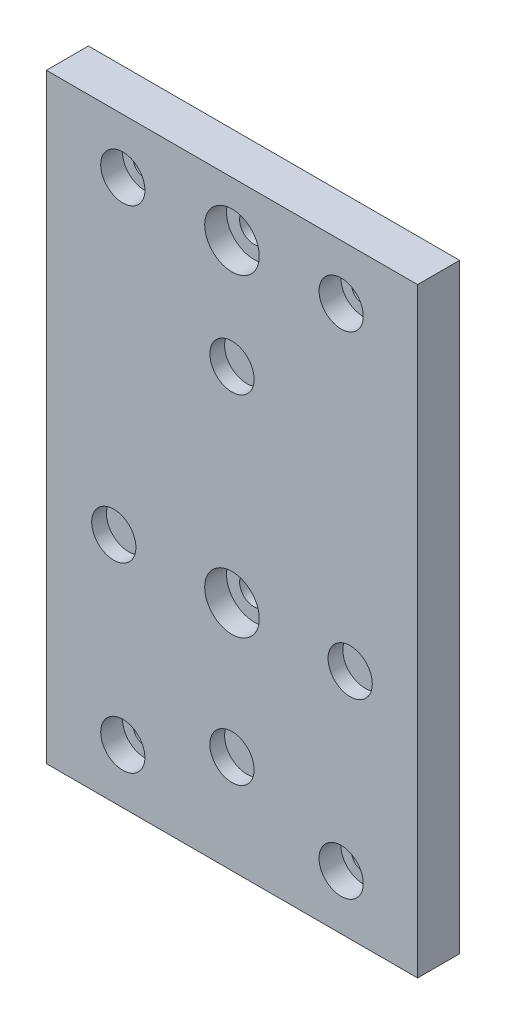
ISO-10303-21;
HEADER;
FILE_DESCRIPTION(('STEP AP214'),'2;1');
FILE_NAME('part.step','',(''),(''),'','','');
FILE_SCHEMA(('AUTOMOTIVE_DESIGN { 1 0 10303 214 1 1 1 1 }'));
ENDSEC;
DATA;
#1=APPLICATION_CONTEXT('core data for automotive mechanical design processes');
#2=APPLICATION_PROTOCOL_DEFINITION('international standard','automotive_design',2000,#1);
#3=PRODUCT_CONTEXT('',#1,'mechanical');
#4=PRODUCT('Part','Part','',(#3));
#5=PRODUCT_RELATED_PRODUCT_CATEGORY('part','',(#4));
#6=PRODUCT_DEFINITION_FORMATION('','',#4);
#7=PRODUCT_DEFINITION_CONTEXT('part definition',#1,'design');
#8=PRODUCT_DEFINITION('design','',#6,#7);
#9=PRODUCT_DEFINITION_SHAPE('','',#8);
#10=(LENGTH_UNIT() NAMED_UNIT(*) SI_UNIT(.MILLI.,.METRE.));
#11=(NAMED_UNIT(*) PLANE_ANGLE_UNIT() SI_UNIT($,.RADIAN.));
#12=(NAMED_UNIT(*) SI_UNIT($,.STERADIAN.) SOLID_ANGLE_UNIT());
#13=UNCERTAINTY_MEASURE_WITH_UNIT(LENGTH_MEASURE(1.E-05),#10,'distance_accuracy_value','');
#14=(GEOMETRIC_REPRESENTATION_CONTEXT(3) GLOBAL_UNCERTAINTY_ASSIGNED_CONTEXT((#13)) GLOBAL_UNIT_ASSIGNED_CONTEXT((#10,
#11,#12)) REPRESENTATION_CONTEXT('',''));
#15=CARTESIAN_POINT('',(0.,0.,0.));
#16=DIRECTION('',(0.,0.,1.));
#17=DIRECTION('',(1.,0.,0.));
#18=AXIS2_PLACEMENT_3D('',#15,#16,#17);
#19=CARTESIAN_POINT('',(0.,-36.95,7.7));
#20=DIRECTION('',(0.,0.,-1.));
#21=DIRECTION('',(-1.,0.,0.));
#22=AXIS2_PLACEMENT_3D('',#19,#20,#21);
#23=CYLINDRICAL_SURFACE('',#22,4.05);
#24=CARTESIAN_POINT('',(0.,-36.95,7.7));
#25=DIRECTION('',(0.,0.,1.));
#26=DIRECTION('',(1.,0.,0.));
#27=AXIS2_PLACEMENT_3D('',#24,#25,#26);
#28=CIRCLE('',#27,4.05);
#29=CARTESIAN_POINT('',(4.05,-36.95,7.7));
#30=VERTEX_POINT('',#29);
#31=EDGE_CURVE('E174',#30,#30,#28,.T.);
#32=ORIENTED_EDGE('',*,*,#31,.T.);
#33=EDGE_LOOP('',(#32));
#34=FACE_BOUND('',#33,.T.);
#35=CARTESIAN_POINT('',(0.,-36.95,5.));
#36=DIRECTION('',(0.,0.,-1.));
#37=DIRECTION('',(-1.,0.,0.));
#38=AXIS2_PLACEMENT_3D('',#35,#36,#37);
#39=CIRCLE('',#38,4.05);
#40=CARTESIAN_POINT('',(-4.05,-36.95,5.));
#41=VERTEX_POINT('',#40);
#42=EDGE_CURVE('E120',#41,#41,#39,.T.);
#43=ORIENTED_EDGE('',*,*,#42,.T.);
#44=EDGE_LOOP('',(#43));
#45=FACE_BOUND('',#44,.T.);
#46=ADVANCED_FACE('F33',(#34,#45),#23,.F.);
#47=CARTESIAN_POINT('',(-21.650635094611,-12.5,7.7));
#48=DIRECTION('',(0.,0.,-1.));
#49=DIRECTION('',(-1.,0.,0.));
#50=AXIS2_PLACEMENT_3D('',#47,#48,#49);
#51=CYLINDRICAL_SURFACE('',#50,4.05);
#52=CARTESIAN_POINT('',(-21.650635094611,-12.5,7.7));
#53=DIRECTION('',(0.,0.,1.));
#54=DIRECTION('',(1.,0.,0.));
#55=AXIS2_PLACEMENT_3D('',#52,#53,#54);
#56=CIRCLE('',#55,4.05);
#57=CARTESIAN_POINT('',(-17.600635094611,-12.5,7.7));
#58=VERTEX_POINT('',#57);
#59=EDGE_CURVE('E171',#58,#58,#56,.T.);
#60=ORIENTED_EDGE('',*,*,#59,.T.);
#61=EDGE_LOOP('',(#60));
#62=FACE_BOUND('',#61,.T.);
#63=CARTESIAN_POINT('',(-21.650635094611,-12.5,5.));
#64=DIRECTION('',(0.,0.,-1.));
#65=DIRECTION('',(-1.,0.,0.));
#66=AXIS2_PLACEMENT_3D('',#63,#64,#65);
#67=CIRCLE('',#66,4.05);
#68=CARTESIAN_POINT('',(-25.700635094611,-12.5,5.));
#69=VERTEX_POINT('',#68);
#70=EDGE_CURVE('E117',#69,#69,#67,.T.);
#71=ORIENTED_EDGE('',*,*,#70,.T.);
#72=EDGE_LOOP('',(#71));
#73=FACE_BOUND('',#72,.T.);
#74=ADVANCED_FACE('F236',(#62,#73),#51,.F.);
#75=CARTESIAN_POINT('',(0.,25.,7.7));
#76=DIRECTION('',(0.,0.,-1.));
#77=DIRECTION('',(-1.,0.,0.));
#78=AXIS2_PLACEMENT_3D('',#75,#76,#77);
#79=CYLINDRICAL_SURFACE('',#78,4.05);
#80=CARTESIAN_POINT('',(0.,25.,7.7));
#81=DIRECTION('',(0.,0.,1.));
#82=DIRECTION('',(1.,0.,0.));
#83=AXIS2_PLACEMENT_3D('',#80,#81,#82);
#84=CIRCLE('',#83,4.05);
#85=CARTESIAN_POINT('',(4.04999999999999,25.,7.7));
#86=VERTEX_POINT('',#85);
#87=EDGE_CURVE('E168',#86,#86,#84,.T.);
#88=ORIENTED_EDGE('',*,*,#87,.T.);
#89=EDGE_LOOP('',(#88));
#90=FACE_BOUND('',#89,.T.);
#91=CARTESIAN_POINT('',(0.,25.,5.));
#92=DIRECTION('',(0.,0.,-1.));
#93=DIRECTION('',(-1.,0.,0.));
#94=AXIS2_PLACEMENT_3D('',#91,#92,#93);
#95=CIRCLE('',#94,4.05);
#96=CARTESIAN_POINT('',(-4.05000000000001,25.,5.));
#97=VERTEX_POINT('',#96);
#98=EDGE_CURVE('E114',#97,#97,#95,.T.);
#99=ORIENTED_EDGE('',*,*,#98,.T.);
#100=EDGE_LOOP('',(#99));
#101=FACE_BOUND('',#100,.T.);
#102=ADVANCED_FACE('F242',(#90,#101),#79,.F.);
#103=CARTESIAN_POINT('',(21.650635094611,-12.5,7.7));
#104=DIRECTION('',(0.,0.,-1.));
#105=DIRECTION('',(-1.,0.,0.));
#106=AXIS2_PLACEMENT_3D('',#103,#104,#105);
#107=CYLINDRICAL_SURFACE('',#106,4.05);
#108=CARTESIAN_POINT('',(21.650635094611,-12.5,7.7));
#109=DIRECTION('',(0.,0.,1.));
#110=DIRECTION('',(1.,0.,0.));
#111=AXIS2_PLACEMENT_3D('',#108,#109,#110);
#112=CIRCLE('',#111,4.05);
#113=CARTESIAN_POINT('',(25.700635094611,-12.5,7.7));
#114=VERTEX_POINT('',#113);
#115=EDGE_CURVE('E165',#114,#114,#112,.T.);
#116=ORIENTED_EDGE('',*,*,#115,.T.);
#117=EDGE_LOOP('',(#116));
#118=FACE_BOUND('',#117,.T.);
#119=CARTESIAN_POINT('',(21.650635094611,-12.5,5.));
#120=DIRECTION('',(0.,0.,-1.));
#121=DIRECTION('',(-1.,0.,0.));
#122=AXIS2_PLACEMENT_3D('',#119,#120,#121);
#123=CIRCLE('',#122,4.05);
#124=CARTESIAN_POINT('',(17.600635094611,-12.5,5.));
#125=VERTEX_POINT('',#124);
#126=EDGE_CURVE('E110',#125,#125,#123,.T.);
#127=ORIENTED_EDGE('',*,*,#126,.T.);
#128=EDGE_LOOP('',(#127));
#129=FACE_BOUND('',#128,.T.);
#130=ADVANCED_FACE('F252',(#118,#129),#107,.F.);
#131=CARTESIAN_POINT('',(0.,0.,7.7));
#132=DIRECTION('',(0.,0.,1.));
#133=DIRECTION('',(1.,0.,0.));
#134=AXIS2_PLACEMENT_3D('',#131,#132,#133);
#135=PLANE('',#134);
#136=CARTESIAN_POINT('',(0.,45.,7.7));
#137=DIRECTION('',(0.,0.,-1.));
#138=DIRECTION('',(-1.,0.,0.));
#139=AXIS2_PLACEMENT_3D('',#136,#137,#138);
#140=CIRCLE('',#139,5.);
#141=CARTESIAN_POINT('',(-5.00000000000001,45.,7.7));
#142=VERTEX_POINT('',#141);
#143=EDGE_CURVE('E200',#142,#142,#140,.T.);
#144=ORIENTED_EDGE('',*,*,#143,.T.);
#145=EDGE_LOOP('',(#144));
#146=FACE_BOUND('',#145,.T.);
#147=CARTESIAN_POINT('',(-20.,-45.,7.7));
#148=DIRECTION('',(0.,0.,-1.));
#149=DIRECTION('',(-1.,0.,0.));
#150=AXIS2_PLACEMENT_3D('',#147,#148,#149);
#151=CIRCLE('',#150,4.05);
#152=CARTESIAN_POINT('',(-24.05,-45.,7.7));
#153=VERTEX_POINT('',#152);
#154=EDGE_CURVE('E207',#153,#153,#151,.T.);
#155=ORIENTED_EDGE('',*,*,#154,.T.);
#156=EDGE_LOOP('',(#155));
#157=FACE_BOUND('',#156,.T.);
#158=CARTESIAN_POINT('',(20.,-45.,7.7));
#159=DIRECTION('',(0.,0.,-1.));
#160=DIRECTION('',(-1.,0.,0.));
#161=AXIS2_PLACEMENT_3D('',#158,#159,#160);
#162=CIRCLE('',#161,4.05);
#163=CARTESIAN_POINT('',(15.95,-45.,7.7));
#164=VERTEX_POINT('',#163);
#165=EDGE_CURVE('E188',#164,#164,#162,.T.);
#166=ORIENTED_EDGE('',*,*,#165,.T.);
#167=EDGE_LOOP('',(#166));
#168=FACE_BOUND('',#167,.T.);
#169=CARTESIAN_POINT('',(-20.,45.,7.7));
#170=DIRECTION('',(0.,0.,-1.));
#171=DIRECTION('',(-1.,0.,0.));
#172=AXIS2_PLACEMENT_3D('',#169,#170,#171);
#173=CIRCLE('',#172,4.05);
#174=CARTESIAN_POINT('',(-24.05,45.,7.7));
#175=VERTEX_POINT('',#174);
#176=EDGE_CURVE('E195',#175,#175,#173,.T.);
#177=ORIENTED_EDGE('',*,*,#176,.T.);
#178=EDGE_LOOP('',(#177));
#179=FACE_BOUND('',#178,.T.);
#180=CARTESIAN_POINT('',(0.,-12.5,7.7));
#181=DIRECTION('',(0.,0.,-1.));
#182=DIRECTION('',(-1.,0.,0.));
#183=AXIS2_PLACEMENT_3D('',#180,#181,#182);
#184=CIRCLE('',#183,5.);
#185=CARTESIAN_POINT('',(-5.00000000000001,-12.5,7.7));
#186=VERTEX_POINT('',#185);
#187=EDGE_CURVE('E212',#186,#186,#184,.T.);
#188=ORIENTED_EDGE('',*,*,#187,.T.);
#189=EDGE_LOOP('',(#188));
#190=FACE_BOUND('',#189,.T.);
#191=CARTESIAN_POINT('',(20.,45.,7.7));
#192=DIRECTION('',(0.,0.,-1.));
#193=DIRECTION('',(-1.,0.,0.));
#194=AXIS2_PLACEMENT_3D('',#191,#192,#193);
#195=CIRCLE('',#194,4.05);
#196=CARTESIAN_POINT('',(15.95,45.,7.7));
#197=VERTEX_POINT('',#196);
#198=EDGE_CURVE('E182',#197,#197,#195,.T.);
#199=ORIENTED_EDGE('',*,*,#198,.T.);
#200=EDGE_LOOP('',(#199));
#201=FACE_BOUND('',#200,.T.);
#202=ORIENTED_EDGE('',*,*,#59,.F.);
#203=EDGE_LOOP('',(#202));
#204=FACE_BOUND('',#203,.T.);
#205=ORIENTED_EDGE('',*,*,#115,.F.);
#206=EDGE_LOOP('',(#205));
#207=FACE_BOUND('',#206,.T.);
#208=DIRECTION('',(0.,1.,0.));
#209=VECTOR('',#208,1.);
#210=CARTESIAN_POINT('',(34.,55.,7.7));
#211=LINE('',#210,#209);
#212=CARTESIAN_POINT('',(34.,-55.,7.7));
#213=VERTEX_POINT('',#212);
#214=CARTESIAN_POINT('',(34.,55.,7.7));
#215=VERTEX_POINT('',#214);
#216=EDGE_CURVE('E88',#213,#215,#211,.T.);
#217=ORIENTED_EDGE('',*,*,#216,.T.);
#218=DIRECTION('',(-1.,0.,0.));
#219=VECTOR('',#218,1.);
#220=CARTESIAN_POINT('',(-34.,55.,7.7));
#221=LINE('',#220,#219);
#222=CARTESIAN_POINT('',(-34.,55.,7.7));
#223=VERTEX_POINT('',#222);
#224=EDGE_CURVE('E82',#215,#223,#221,.T.);
#225=ORIENTED_EDGE('',*,*,#224,.T.);
#226=DIRECTION('',(0.,-1.,0.));
#227=VECTOR('',#226,1.);
#228=CARTESIAN_POINT('',(-34.,55.,7.7));
#229=LINE('',#228,#227);
#230=CARTESIAN_POINT('',(-34.,-55.,7.7));
#231=VERTEX_POINT('',#230);
#232=EDGE_CURVE('E86',#223,#231,#229,.T.);
#233=ORIENTED_EDGE('',*,*,#232,.T.);
#234=DIRECTION('',(1.,0.,0.));
#235=VECTOR('',#234,1.);
#236=CARTESIAN_POINT('',(-34.,-55.,7.7));
#237=LINE('',#236,#235);
#238=EDGE_CURVE('E52',#231,#213,#237,.T.);
#239=ORIENTED_EDGE('',*,*,#238,.T.);
#240=EDGE_LOOP('',(#217,#225,#233,#239));
#241=FACE_BOUND('',#240,.T.);
#242=ORIENTED_EDGE('',*,*,#87,.F.);
#243=EDGE_LOOP('',(#242));
#244=FACE_BOUND('',#243,.T.);
#245=ORIENTED_EDGE('',*,*,#31,.F.);
#246=EDGE_LOOP('',(#245));
#247=FACE_BOUND('',#246,.T.);
#248=ADVANCED_FACE('F83',(#146,#157,#168,#179,#190,#201,#204,#207,#241,#244,#247),#135,.T.);
#249=CARTESIAN_POINT('',(0.,0.,0.));
#250=DIRECTION('',(0.,0.,1.));
#251=DIRECTION('',(1.,0.,0.));
#252=AXIS2_PLACEMENT_3D('',#249,#250,#251);
#253=PLANE('',#252);
#254=DIRECTION('',(0.,1.,0.));
#255=VECTOR('',#254,1.);
#256=CARTESIAN_POINT('',(34.,55.,0.));
#257=LINE('',#256,#255);
#258=CARTESIAN_POINT('',(34.,-55.,0.));
#259=VERTEX_POINT('',#258);
#260=CARTESIAN_POINT('',(34.,55.,0.));
#261=VERTEX_POINT('',#260);
#262=EDGE_CURVE('E101',#259,#261,#257,.T.);
#263=ORIENTED_EDGE('',*,*,#262,.F.);
#264=DIRECTION('',(1.,0.,0.));
#265=VECTOR('',#264,1.);
#266=CARTESIAN_POINT('',(-34.,-55.,0.));
#267=LINE('',#266,#265);
#268=CARTESIAN_POINT('',(-34.,-55.,0.));
#269=VERTEX_POINT('',#268);
#270=EDGE_CURVE('E75',#269,#259,#267,.T.);
#271=ORIENTED_EDGE('',*,*,#270,.F.);
#272=DIRECTION('',(0.,-1.,0.));
#273=VECTOR('',#272,1.);
#274=CARTESIAN_POINT('',(-34.,55.,0.));
#275=LINE('',#274,#273);
#276=CARTESIAN_POINT('',(-34.,55.,0.));
#277=VERTEX_POINT('',#276);
#278=EDGE_CURVE('E69',#277,#269,#275,.T.);
#279=ORIENTED_EDGE('',*,*,#278,.F.);
#280=DIRECTION('',(-1.,0.,0.));
#281=VECTOR('',#280,1.);
#282=CARTESIAN_POINT('',(-34.,55.,0.));
#283=LINE('',#282,#281);
#284=EDGE_CURVE('E92',#261,#277,#283,.T.);
#285=ORIENTED_EDGE('',*,*,#284,.F.);
#286=EDGE_LOOP('',(#263,#271,#279,#285));
#287=FACE_BOUND('',#286,.T.);
#288=CARTESIAN_POINT('',(20.,45.,0.));
#289=DIRECTION('',(0.,0.,1.));
#290=DIRECTION('',(1.,0.,0.));
#291=AXIS2_PLACEMENT_3D('',#288,#289,#290);
#292=CIRCLE('',#291,2.1);
#293=CARTESIAN_POINT('',(22.1,45.,0.));
#294=VERTEX_POINT('',#293);
#295=EDGE_CURVE('E104',#294,#294,#292,.T.);
#296=ORIENTED_EDGE('',*,*,#295,.T.);
#297=EDGE_LOOP('',(#296));
#298=FACE_BOUND('',#297,.T.);
#299=CARTESIAN_POINT('',(-20.,45.,0.));
#300=DIRECTION('',(0.,0.,1.));
#301=DIRECTION('',(1.,0.,0.));
#302=AXIS2_PLACEMENT_3D('',#299,#300,#301);
#303=CIRCLE('',#302,2.1);
#304=CARTESIAN_POINT('',(-17.9,45.,0.));
#305=VERTEX_POINT('',#304);
#306=EDGE_CURVE('E154',#305,#305,#303,.T.);
#307=ORIENTED_EDGE('',*,*,#306,.T.);
#308=EDGE_LOOP('',(#307));
#309=FACE_BOUND('',#308,.T.);
#310=CARTESIAN_POINT('',(20.,-45.,0.));
#311=DIRECTION('',(0.,0.,1.));
#312=DIRECTION('',(1.,0.,0.));
#313=AXIS2_PLACEMENT_3D('',#310,#311,#312);
#314=CIRCLE('',#313,2.1);
#315=CARTESIAN_POINT('',(22.1,-45.,0.));
#316=VERTEX_POINT('',#315);
#317=EDGE_CURVE('E157',#316,#316,#314,.T.);
#318=ORIENTED_EDGE('',*,*,#317,.T.);
#319=EDGE_LOOP('',(#318));
#320=FACE_BOUND('',#319,.T.);
#321=CARTESIAN_POINT('',(-20.,-45.,0.));
#322=DIRECTION('',(0.,0.,1.));
#323=DIRECTION('',(1.,0.,0.));
#324=AXIS2_PLACEMENT_3D('',#321,#322,#323);
#325=CIRCLE('',#324,2.1);
#326=CARTESIAN_POINT('',(-17.9,-45.,0.));
#327=VERTEX_POINT('',#326);
#328=EDGE_CURVE('E162',#327,#327,#325,.T.);
#329=ORIENTED_EDGE('',*,*,#328,.T.);
#330=EDGE_LOOP('',(#329));
#331=FACE_BOUND('',#330,.T.);
#332=CARTESIAN_POINT('',(0.,45.,0.));
#333=DIRECTION('',(0.,0.,1.));
#334=DIRECTION('',(1.,0.,0.));
#335=AXIS2_PLACEMENT_3D('',#332,#333,#334);
#336=CIRCLE('',#335,2.6);
#337=CARTESIAN_POINT('',(2.59999999999999,45.,0.));
#338=VERTEX_POINT('',#337);
#339=EDGE_CURVE('E177',#338,#338,#336,.T.);
#340=ORIENTED_EDGE('',*,*,#339,.T.);
#341=EDGE_LOOP('',(#340));
#342=FACE_BOUND('',#341,.T.);
#343=CARTESIAN_POINT('',(0.,-12.5,0.));
#344=DIRECTION('',(0.,0.,1.));
#345=DIRECTION('',(1.,0.,0.));
#346=AXIS2_PLACEMENT_3D('',#343,#344,#345);
#347=CIRCLE('',#346,2.6);
#348=CARTESIAN_POINT('',(2.59999999999999,-12.5,0.));
#349=VERTEX_POINT('',#348);
#350=EDGE_CURVE('E113',#349,#349,#347,.T.);
#351=ORIENTED_EDGE('',*,*,#350,.T.);
#352=EDGE_LOOP('',(#351));
#353=FACE_BOUND('',#352,.T.);
#354=ADVANCED_FACE('F270',(#287,#298,#309,#320,#331,#342,#353),#253,.F.);
#355=CARTESIAN_POINT('',(34.,55.,7.7));
#356=DIRECTION('',(-1.,0.,0.));
#357=DIRECTION('',(0.,-1.,0.));
#358=AXIS2_PLACEMENT_3D('',#355,#356,#357);
#359=PLANE('',#358);
#360=ORIENTED_EDGE('',*,*,#262,.T.);
#361=DIRECTION('',(0.,0.,-1.));
#362=VECTOR('',#361,1.);
#363=CARTESIAN_POINT('',(34.,55.,7.7));
#364=LINE('',#363,#362);
#365=EDGE_CURVE('E11',#215,#261,#364,.T.);
#366=ORIENTED_EDGE('',*,*,#365,.F.);
#367=ORIENTED_EDGE('',*,*,#216,.F.);
#368=DIRECTION('',(0.,0.,-1.));
#369=VECTOR('',#368,1.);
#370=CARTESIAN_POINT('',(34.,-55.,7.7));
#371=LINE('',#370,#369);
#372=EDGE_CURVE('E97',#213,#259,#371,.T.);
#373=ORIENTED_EDGE('',*,*,#372,.T.);
#374=EDGE_LOOP('',(#360,#366,#367,#373));
#375=FACE_BOUND('',#374,.T.);
#376=ADVANCED_FACE('F35',(#375),#359,.F.);
#377=CARTESIAN_POINT('',(-34.,55.,7.7));
#378=DIRECTION('',(0.,-1.,0.));
#379=DIRECTION('',(0.,0.,-1.));
#380=AXIS2_PLACEMENT_3D('',#377,#378,#379);
#381=PLANE('',#380);
#382=ORIENTED_EDGE('',*,*,#284,.T.);
#383=DIRECTION('',(0.,0.,-1.));
#384=VECTOR('',#383,1.);
#385=CARTESIAN_POINT('',(-34.,55.,7.7));
#386=LINE('',#385,#384);
#387=EDGE_CURVE('E43',#223,#277,#386,.T.);
#388=ORIENTED_EDGE('',*,*,#387,.F.);
#389=ORIENTED_EDGE('',*,*,#224,.F.);
#390=ORIENTED_EDGE('',*,*,#365,.T.);
#391=EDGE_LOOP('',(#382,#388,#389,#390));
#392=FACE_BOUND('',#391,.T.);
#393=ADVANCED_FACE('F91',(#392),#381,.F.);
#394=CARTESIAN_POINT('',(-34.,55.,7.7));
#395=DIRECTION('',(1.,0.,0.));
#396=DIRECTION('',(0.,1.,0.));
#397=AXIS2_PLACEMENT_3D('',#394,#395,#396);
#398=PLANE('',#397);
#399=ORIENTED_EDGE('',*,*,#278,.T.);
#400=DIRECTION('',(0.,0.,-1.));
#401=VECTOR('',#400,1.);
#402=CARTESIAN_POINT('',(-34.,-55.,7.7));
#403=LINE('',#402,#401);
#404=EDGE_CURVE('E93',#231,#269,#403,.T.);
#405=ORIENTED_EDGE('',*,*,#404,.F.);
#406=ORIENTED_EDGE('',*,*,#232,.F.);
#407=ORIENTED_EDGE('',*,*,#387,.T.);
#408=EDGE_LOOP('',(#399,#405,#406,#407));
#409=FACE_BOUND('',#408,.T.);
#410=ADVANCED_FACE('F95',(#409),#398,.F.);
#411=CARTESIAN_POINT('',(-34.,-55.,7.7));
#412=DIRECTION('',(0.,1.,0.));
#413=DIRECTION('',(0.,0.,1.));
#414=AXIS2_PLACEMENT_3D('',#411,#412,#413);
#415=PLANE('',#414);
#416=ORIENTED_EDGE('',*,*,#270,.T.);
#417=ORIENTED_EDGE('',*,*,#372,.F.);
#418=ORIENTED_EDGE('',*,*,#238,.F.);
#419=ORIENTED_EDGE('',*,*,#404,.T.);
#420=EDGE_LOOP('',(#416,#417,#418,#419));
#421=FACE_BOUND('',#420,.T.);
#422=ADVANCED_FACE('F149',(#421),#415,.F.);
#423=CARTESIAN_POINT('',(20.,45.,7.7));
#424=DIRECTION('',(0.,0.,-1.));
#425=DIRECTION('',(-1.,0.,0.));
#426=AXIS2_PLACEMENT_3D('',#423,#424,#425);
#427=CYLINDRICAL_SURFACE('',#426,2.1);
#428=CARTESIAN_POINT('',(20.,45.,3.7));
#429=DIRECTION('',(0.,0.,-1.));
#430=DIRECTION('',(-1.,0.,0.));
#431=AXIS2_PLACEMENT_3D('',#428,#429,#430);
#432=CIRCLE('',#431,2.1);
#433=CARTESIAN_POINT('',(17.9,45.,3.7));
#434=VERTEX_POINT('',#433);
#435=EDGE_CURVE('E37',#434,#434,#432,.T.);
#436=ORIENTED_EDGE('',*,*,#435,.F.);
#437=EDGE_LOOP('',(#436));
#438=FACE_BOUND('',#437,.T.);
#439=ORIENTED_EDGE('',*,*,#295,.F.);
#440=EDGE_LOOP('',(#439));
#441=FACE_BOUND('',#440,.T.);
#442=ADVANCED_FACE('F145',(#438,#441),#427,.F.);
#443=CARTESIAN_POINT('',(-20.,45.,7.7));
#444=DIRECTION('',(0.,0.,-1.));
#445=DIRECTION('',(-1.,0.,0.));
#446=AXIS2_PLACEMENT_3D('',#443,#444,#445);
#447=CYLINDRICAL_SURFACE('',#446,2.1);
#448=CARTESIAN_POINT('',(-20.,45.,3.7));
#449=DIRECTION('',(0.,0.,-1.));
#450=DIRECTION('',(-1.,0.,0.));
#451=AXIS2_PLACEMENT_3D('',#448,#449,#450);
#452=CIRCLE('',#451,2.1);
#453=CARTESIAN_POINT('',(-22.1,45.,3.7));
#454=VERTEX_POINT('',#453);
#455=EDGE_CURVE('E135',#454,#454,#452,.T.);
#456=ORIENTED_EDGE('',*,*,#455,.F.);
#457=EDGE_LOOP('',(#456));
#458=FACE_BOUND('',#457,.T.);
#459=ORIENTED_EDGE('',*,*,#306,.F.);
#460=EDGE_LOOP('',(#459));
#461=FACE_BOUND('',#460,.T.);
#462=ADVANCED_FACE('F148',(#458,#461),#447,.F.);
#463=CARTESIAN_POINT('',(20.,-45.,7.7));
#464=DIRECTION('',(0.,0.,-1.));
#465=DIRECTION('',(-1.,0.,0.));
#466=AXIS2_PLACEMENT_3D('',#463,#464,#465);
#467=CYLINDRICAL_SURFACE('',#466,2.1);
#468=CARTESIAN_POINT('',(20.,-45.,3.7));
#469=DIRECTION('',(0.,0.,-1.));
#470=DIRECTION('',(-1.,0.,0.));
#471=AXIS2_PLACEMENT_3D('',#468,#469,#470);
#472=CIRCLE('',#471,2.1);
#473=CARTESIAN_POINT('',(17.9,-45.,3.7));
#474=VERTEX_POINT('',#473);
#475=EDGE_CURVE('E133',#474,#474,#472,.T.);
#476=ORIENTED_EDGE('',*,*,#475,.F.);
#477=EDGE_LOOP('',(#476));
#478=FACE_BOUND('',#477,.T.);
#479=ORIENTED_EDGE('',*,*,#317,.F.);
#480=EDGE_LOOP('',(#479));
#481=FACE_BOUND('',#480,.T.);
#482=ADVANCED_FACE('F260',(#478,#481),#467,.F.);
#483=CARTESIAN_POINT('',(-20.,-45.,7.7));
#484=DIRECTION('',(0.,0.,-1.));
#485=DIRECTION('',(-1.,0.,0.));
#486=AXIS2_PLACEMENT_3D('',#483,#484,#485);
#487=CYLINDRICAL_SURFACE('',#486,2.1);
#488=CARTESIAN_POINT('',(-20.,-45.,3.7));
#489=DIRECTION('',(0.,0.,-1.));
#490=DIRECTION('',(-1.,0.,0.));
#491=AXIS2_PLACEMENT_3D('',#488,#489,#490);
#492=CIRCLE('',#491,2.1);
#493=CARTESIAN_POINT('',(-22.1,-45.,3.7));
#494=VERTEX_POINT('',#493);
#495=EDGE_CURVE('E130',#494,#494,#492,.T.);
#496=ORIENTED_EDGE('',*,*,#495,.F.);
#497=EDGE_LOOP('',(#496));
#498=FACE_BOUND('',#497,.T.);
#499=ORIENTED_EDGE('',*,*,#328,.F.);
#500=EDGE_LOOP('',(#499));
#501=FACE_BOUND('',#500,.T.);
#502=ADVANCED_FACE('F257',(#498,#501),#487,.F.);
#503=CARTESIAN_POINT('',(0.,45.,7.7));
#504=DIRECTION('',(0.,0.,-1.));
#505=DIRECTION('',(-1.,0.,0.));
#506=AXIS2_PLACEMENT_3D('',#503,#504,#505);
#507=CYLINDRICAL_SURFACE('',#506,2.6);
#508=CARTESIAN_POINT('',(0.,45.,3.7));
#509=DIRECTION('',(0.,0.,-1.));
#510=DIRECTION('',(-1.,0.,0.));
#511=AXIS2_PLACEMENT_3D('',#508,#509,#510);
#512=CIRCLE('',#511,2.6);
#513=CARTESIAN_POINT('',(-2.60000000000001,45.,3.7));
#514=VERTEX_POINT('',#513);
#515=EDGE_CURVE('E126',#514,#514,#512,.T.);
#516=ORIENTED_EDGE('',*,*,#515,.F.);
#517=EDGE_LOOP('',(#516));
#518=FACE_BOUND('',#517,.T.);
#519=ORIENTED_EDGE('',*,*,#339,.F.);
#520=EDGE_LOOP('',(#519));
#521=FACE_BOUND('',#520,.T.);
#522=ADVANCED_FACE('F247',(#518,#521),#507,.F.);
#523=CARTESIAN_POINT('',(0.,-12.5,7.7));
#524=DIRECTION('',(0.,0.,-1.));
#525=DIRECTION('',(-1.,0.,0.));
#526=AXIS2_PLACEMENT_3D('',#523,#524,#525);
#527=CYLINDRICAL_SURFACE('',#526,2.6);
#528=CARTESIAN_POINT('',(0.,-12.5,3.7));
#529=DIRECTION('',(0.,0.,-1.));
#530=DIRECTION('',(-1.,0.,0.));
#531=AXIS2_PLACEMENT_3D('',#528,#529,#530);
#532=CIRCLE('',#531,2.6);
#533=CARTESIAN_POINT('',(-2.60000000000001,-12.5,3.7));
#534=VERTEX_POINT('',#533);
#535=EDGE_CURVE('E123',#534,#534,#532,.T.);
#536=ORIENTED_EDGE('',*,*,#535,.F.);
#537=EDGE_LOOP('',(#536));
#538=FACE_BOUND('',#537,.T.);
#539=ORIENTED_EDGE('',*,*,#350,.F.);
#540=EDGE_LOOP('',(#539));
#541=FACE_BOUND('',#540,.T.);
#542=ADVANCED_FACE('F297',(#538,#541),#527,.F.);
#543=CARTESIAN_POINT('',(21.650635094611,-12.5,5.));
#544=DIRECTION('',(0.,0.,-1.));
#545=DIRECTION('',(-1.,0.,0.));
#546=AXIS2_PLACEMENT_3D('',#543,#544,#545);
#547=PLANE('',#546);
#548=ORIENTED_EDGE('',*,*,#126,.F.);
#549=EDGE_LOOP('',(#548));
#550=FACE_BOUND('',#549,.T.);
#551=ADVANCED_FACE('F299',(#550),#547,.F.);
#552=CARTESIAN_POINT('',(0.,25.,5.));
#553=DIRECTION('',(0.,0.,-1.));
#554=DIRECTION('',(-1.,0.,0.));
#555=AXIS2_PLACEMENT_3D('',#552,#553,#554);
#556=PLANE('',#555);
#557=ORIENTED_EDGE('',*,*,#98,.F.);
#558=EDGE_LOOP('',(#557));
#559=FACE_BOUND('',#558,.T.);
#560=ADVANCED_FACE('F305',(#559),#556,.F.);
#561=CARTESIAN_POINT('',(-21.650635094611,-12.5,5.));
#562=DIRECTION('',(0.,0.,-1.));
#563=DIRECTION('',(-1.,0.,0.));
#564=AXIS2_PLACEMENT_3D('',#561,#562,#563);
#565=PLANE('',#564);
#566=ORIENTED_EDGE('',*,*,#70,.F.);
#567=EDGE_LOOP('',(#566));
#568=FACE_BOUND('',#567,.T.);
#569=ADVANCED_FACE('F313',(#568),#565,.F.);
#570=CARTESIAN_POINT('',(0.,-36.95,5.));
#571=DIRECTION('',(0.,0.,-1.));
#572=DIRECTION('',(-1.,0.,0.));
#573=AXIS2_PLACEMENT_3D('',#570,#571,#572);
#574=PLANE('',#573);
#575=ORIENTED_EDGE('',*,*,#42,.F.);
#576=EDGE_LOOP('',(#575));
#577=FACE_BOUND('',#576,.T.);
#578=ADVANCED_FACE('F233',(#577),#574,.F.);
#579=CARTESIAN_POINT('',(0.,-12.5,3.7));
#580=DIRECTION('',(0.,0.,1.));
#581=DIRECTION('',(1.,0.,0.));
#582=AXIS2_PLACEMENT_3D('',#579,#580,#581);
#583=CYLINDRICAL_SURFACE('',#582,5.);
#584=CARTESIAN_POINT('',(0.,-12.5,3.7));
#585=DIRECTION('',(0.,0.,-1.));
#586=DIRECTION('',(-1.,0.,0.));
#587=AXIS2_PLACEMENT_3D('',#584,#585,#586);
#588=CIRCLE('',#587,5.);
#589=CARTESIAN_POINT('',(-5.00000000000001,-12.5,3.7));
#590=VERTEX_POINT('',#589);
#591=EDGE_CURVE('E204',#590,#590,#588,.T.);
#592=ORIENTED_EDGE('',*,*,#591,.T.);
#593=EDGE_LOOP('',(#592));
#594=FACE_BOUND('',#593,.T.);
#595=ORIENTED_EDGE('',*,*,#187,.F.);
#596=EDGE_LOOP('',(#595));
#597=FACE_BOUND('',#596,.T.);
#598=ADVANCED_FACE('F218',(#594,#597),#583,.F.);
#599=CARTESIAN_POINT('',(0.,-12.5,3.7));
#600=DIRECTION('',(0.,0.,-1.));
#601=DIRECTION('',(-1.,0.,0.));
#602=AXIS2_PLACEMENT_3D('',#599,#600,#601);
#603=PLANE('',#602);
#604=ORIENTED_EDGE('',*,*,#535,.T.);
#605=EDGE_LOOP('',(#604));
#606=FACE_BOUND('',#605,.T.);
#607=ORIENTED_EDGE('',*,*,#591,.F.);
#608=EDGE_LOOP('',(#607));
#609=FACE_BOUND('',#608,.T.);
#610=ADVANCED_FACE('F221',(#606,#609),#603,.F.);
#611=CARTESIAN_POINT('',(0.,45.,3.7));
#612=DIRECTION('',(0.,0.,1.));
#613=DIRECTION('',(1.,0.,0.));
#614=AXIS2_PLACEMENT_3D('',#611,#612,#613);
#615=CYLINDRICAL_SURFACE('',#614,5.);
#616=CARTESIAN_POINT('',(0.,45.,3.7));
#617=DIRECTION('',(0.,0.,-1.));
#618=DIRECTION('',(-1.,0.,0.));
#619=AXIS2_PLACEMENT_3D('',#616,#617,#618);
#620=CIRCLE('',#619,5.);
#621=CARTESIAN_POINT('',(-5.00000000000001,45.,3.7));
#622=VERTEX_POINT('',#621);
#623=EDGE_CURVE('E203',#622,#622,#620,.T.);
#624=ORIENTED_EDGE('',*,*,#623,.T.);
#625=EDGE_LOOP('',(#624));
#626=FACE_BOUND('',#625,.T.);
#627=ORIENTED_EDGE('',*,*,#143,.F.);
#628=EDGE_LOOP('',(#627));
#629=FACE_BOUND('',#628,.T.);
#630=ADVANCED_FACE('F223',(#626,#629),#615,.F.);
#631=CARTESIAN_POINT('',(0.,45.,3.7));
#632=DIRECTION('',(0.,0.,-1.));
#633=DIRECTION('',(-1.,0.,0.));
#634=AXIS2_PLACEMENT_3D('',#631,#632,#633);
#635=PLANE('',#634);
#636=ORIENTED_EDGE('',*,*,#515,.T.);
#637=EDGE_LOOP('',(#636));
#638=FACE_BOUND('',#637,.T.);
#639=ORIENTED_EDGE('',*,*,#623,.F.);
#640=EDGE_LOOP('',(#639));
#641=FACE_BOUND('',#640,.T.);
#642=ADVANCED_FACE('F230',(#638,#641),#635,.F.);
#643=CARTESIAN_POINT('',(-20.,-45.,3.7));
#644=DIRECTION('',(0.,0.,1.));
#645=DIRECTION('',(1.,0.,0.));
#646=AXIS2_PLACEMENT_3D('',#643,#644,#645);
#647=CYLINDRICAL_SURFACE('',#646,4.05);
#648=CARTESIAN_POINT('',(-20.,-45.,3.7));
#649=DIRECTION('',(0.,0.,-1.));
#650=DIRECTION('',(-1.,0.,0.));
#651=AXIS2_PLACEMENT_3D('',#648,#649,#650);
#652=CIRCLE('',#651,4.05);
#653=CARTESIAN_POINT('',(-24.05,-45.,3.7));
#654=VERTEX_POINT('',#653);
#655=EDGE_CURVE('E192',#654,#654,#652,.T.);
#656=ORIENTED_EDGE('',*,*,#655,.T.);
#657=EDGE_LOOP('',(#656));
#658=FACE_BOUND('',#657,.T.);
#659=ORIENTED_EDGE('',*,*,#154,.F.);
#660=EDGE_LOOP('',(#659));
#661=FACE_BOUND('',#660,.T.);
#662=ADVANCED_FACE('F345',(#658,#661),#647,.F.);
#663=CARTESIAN_POINT('',(-20.,-45.,3.7));
#664=DIRECTION('',(0.,0.,-1.));
#665=DIRECTION('',(-1.,0.,0.));
#666=AXIS2_PLACEMENT_3D('',#663,#664,#665);
#667=PLANE('',#666);
#668=ORIENTED_EDGE('',*,*,#495,.T.);
#669=EDGE_LOOP('',(#668));
#670=FACE_BOUND('',#669,.T.);
#671=ORIENTED_EDGE('',*,*,#655,.F.);
#672=EDGE_LOOP('',(#671));
#673=FACE_BOUND('',#672,.T.);
#674=ADVANCED_FACE('F332',(#670,#673),#667,.F.);
#675=CARTESIAN_POINT('',(20.,-45.,3.7));
#676=DIRECTION('',(0.,0.,1.));
#677=DIRECTION('',(1.,0.,0.));
#678=AXIS2_PLACEMENT_3D('',#675,#676,#677);
#679=CYLINDRICAL_SURFACE('',#678,4.05);
#680=CARTESIAN_POINT('',(20.,-45.,3.7));
#681=DIRECTION('',(0.,0.,-1.));
#682=DIRECTION('',(-1.,0.,0.));
#683=AXIS2_PLACEMENT_3D('',#680,#681,#682);
#684=CIRCLE('',#683,4.05);
#685=CARTESIAN_POINT('',(15.95,-45.,3.7));
#686=VERTEX_POINT('',#685);
#687=EDGE_CURVE('E191',#686,#686,#684,.T.);
#688=ORIENTED_EDGE('',*,*,#687,.T.);
#689=EDGE_LOOP('',(#688));
#690=FACE_BOUND('',#689,.T.);
#691=ORIENTED_EDGE('',*,*,#165,.F.);
#692=EDGE_LOOP('',(#691));
#693=FACE_BOUND('',#692,.T.);
#694=ADVANCED_FACE('F328',(#690,#693),#679,.F.);
#695=CARTESIAN_POINT('',(20.,-45.,3.7));
#696=DIRECTION('',(0.,0.,-1.));
#697=DIRECTION('',(-1.,0.,0.));
#698=AXIS2_PLACEMENT_3D('',#695,#696,#697);
#699=PLANE('',#698);
#700=ORIENTED_EDGE('',*,*,#475,.T.);
#701=EDGE_LOOP('',(#700));
#702=FACE_BOUND('',#701,.T.);
#703=ORIENTED_EDGE('',*,*,#687,.F.);
#704=EDGE_LOOP('',(#703));
#705=FACE_BOUND('',#704,.T.);
#706=ADVANCED_FACE('F331',(#702,#705),#699,.F.);
#707=CARTESIAN_POINT('',(-20.,45.,3.7));
#708=DIRECTION('',(0.,0.,1.));
#709=DIRECTION('',(1.,0.,0.));
#710=AXIS2_PLACEMENT_3D('',#707,#708,#709);
#711=CYLINDRICAL_SURFACE('',#710,4.05);
#712=CARTESIAN_POINT('',(-20.,45.,3.7));
#713=DIRECTION('',(0.,0.,-1.));
#714=DIRECTION('',(-1.,0.,0.));
#715=AXIS2_PLACEMENT_3D('',#712,#713,#714);
#716=CIRCLE('',#715,4.05);
#717=CARTESIAN_POINT('',(-24.05,45.,3.7));
#718=VERTEX_POINT('',#717);
#719=EDGE_CURVE('E185',#718,#718,#716,.T.);
#720=ORIENTED_EDGE('',*,*,#719,.T.);
#721=EDGE_LOOP('',(#720));
#722=FACE_BOUND('',#721,.T.);
#723=ORIENTED_EDGE('',*,*,#176,.F.);
#724=EDGE_LOOP('',(#723));
#725=FACE_BOUND('',#724,.T.);
#726=ADVANCED_FACE('F336',(#722,#725),#711,.F.);
#727=CARTESIAN_POINT('',(-20.,45.,3.7));
#728=DIRECTION('',(0.,0.,-1.));
#729=DIRECTION('',(-1.,0.,0.));
#730=AXIS2_PLACEMENT_3D('',#727,#728,#729);
#731=PLANE('',#730);
#732=ORIENTED_EDGE('',*,*,#455,.T.);
#733=EDGE_LOOP('',(#732));
#734=FACE_BOUND('',#733,.T.);
#735=ORIENTED_EDGE('',*,*,#719,.F.);
#736=EDGE_LOOP('',(#735));
#737=FACE_BOUND('',#736,.T.);
#738=ADVANCED_FACE('F324',(#734,#737),#731,.F.);
#739=CARTESIAN_POINT('',(20.,45.,3.7));
#740=DIRECTION('',(0.,0.,1.));
#741=DIRECTION('',(1.,0.,0.));
#742=AXIS2_PLACEMENT_3D('',#739,#740,#741);
#743=CYLINDRICAL_SURFACE('',#742,4.05);
#744=CARTESIAN_POINT('',(20.,45.,3.7));
#745=DIRECTION('',(0.,0.,-1.));
#746=DIRECTION('',(-1.,0.,0.));
#747=AXIS2_PLACEMENT_3D('',#744,#745,#746);
#748=CIRCLE('',#747,4.05);
#749=CARTESIAN_POINT('',(15.95,45.,3.7));
#750=VERTEX_POINT('',#749);
#751=EDGE_CURVE('E127',#750,#750,#748,.T.);
#752=ORIENTED_EDGE('',*,*,#751,.T.);
#753=EDGE_LOOP('',(#752));
#754=FACE_BOUND('',#753,.T.);
#755=ORIENTED_EDGE('',*,*,#198,.F.);
#756=EDGE_LOOP('',(#755));
#757=FACE_BOUND('',#756,.T.);
#758=ADVANCED_FACE('F321',(#754,#757),#743,.F.);
#759=CARTESIAN_POINT('',(20.,45.,3.7));
#760=DIRECTION('',(0.,0.,-1.));
#761=DIRECTION('',(-1.,0.,0.));
#762=AXIS2_PLACEMENT_3D('',#759,#760,#761);
#763=PLANE('',#762);
#764=ORIENTED_EDGE('',*,*,#435,.T.);
#765=EDGE_LOOP('',(#764));
#766=FACE_BOUND('',#765,.T.);
#767=ORIENTED_EDGE('',*,*,#751,.F.);
#768=EDGE_LOOP('',(#767));
#769=FACE_BOUND('',#768,.T.);
#770=ADVANCED_FACE('F142',(#766,#769),#763,.F.);
#771=CLOSED_SHELL('',(#46,#74,#102,#130,#248,#354,#376,#393,#410,#422,#442,#462,#482,#502,#522,
#542,#551,#560,#569,#578,#598,#610,#630,#642,#662,#674,#694,#706,#726,#738,#758,#770));
#772=MANIFOLD_SOLID_BREP('B2',#771);
#773=ADVANCED_BREP_SHAPE_REPRESENTATION('',(#18,#772),#14);
#774=SHAPE_DEFINITION_REPRESENTATION(#9,#773);
ENDSEC;
END-ISO-10303-21;
